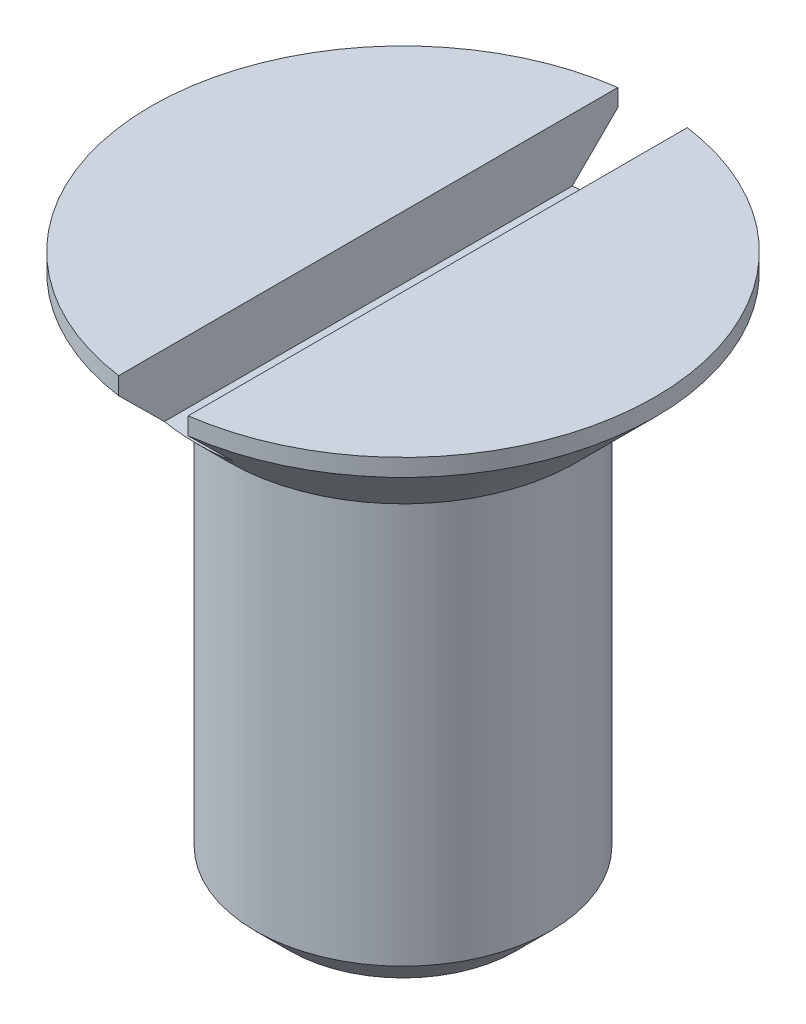
ISO-10303-21;
HEADER;
FILE_DESCRIPTION(('STEP AP214'),'2;1');
FILE_NAME('part.step','',(''),(''),'','','');
FILE_SCHEMA(('AUTOMOTIVE_DESIGN { 1 0 10303 214 1 1 1 1 }'));
ENDSEC;
DATA;
#1=APPLICATION_CONTEXT('core data for automotive mechanical design processes');
#2=APPLICATION_PROTOCOL_DEFINITION('international standard','automotive_design',2000,#1);
#3=PRODUCT_CONTEXT('',#1,'mechanical');
#4=PRODUCT('Part','Part','',(#3));
#5=PRODUCT_RELATED_PRODUCT_CATEGORY('part','',(#4));
#6=PRODUCT_DEFINITION_FORMATION('','',#4);
#7=PRODUCT_DEFINITION_CONTEXT('part definition',#1,'design');
#8=PRODUCT_DEFINITION('design','',#6,#7);
#9=PRODUCT_DEFINITION_SHAPE('','',#8);
#10=(LENGTH_UNIT() NAMED_UNIT(*) SI_UNIT(.MILLI.,.METRE.));
#11=(NAMED_UNIT(*) PLANE_ANGLE_UNIT() SI_UNIT($,.RADIAN.));
#12=(NAMED_UNIT(*) SI_UNIT($,.STERADIAN.) SOLID_ANGLE_UNIT());
#13=UNCERTAINTY_MEASURE_WITH_UNIT(LENGTH_MEASURE(1.E-05),#10,'distance_accuracy_value','');
#14=(GEOMETRIC_REPRESENTATION_CONTEXT(3) GLOBAL_UNCERTAINTY_ASSIGNED_CONTEXT((#13)) GLOBAL_UNIT_ASSIGNED_CONTEXT((#10,
#11,#12)) REPRESENTATION_CONTEXT('',''));
#15=CARTESIAN_POINT('',(0.,0.,0.));
#16=DIRECTION('',(0.,0.,1.));
#17=DIRECTION('',(1.,0.,0.));
#18=AXIS2_PLACEMENT_3D('',#15,#16,#17);
#19=CARTESIAN_POINT('',(0.,0.275,0.));
#20=DIRECTION('',(0.,-1.,0.));
#21=DIRECTION('',(0.,0.,-1.));
#22=AXIS2_PLACEMENT_3D('',#19,#20,#21);
#23=CYLINDRICAL_SURFACE('',#22,0.725);
#24=CARTESIAN_POINT('',(0.,0.275,0.));
#25=DIRECTION('',(0.,1.,0.));
#26=DIRECTION('',(0.,0.,1.));
#27=AXIS2_PLACEMENT_3D('',#24,#25,#26);
#28=CIRCLE('',#27,0.725);
#29=CARTESIAN_POINT('',(0.100000000001111,0.275,0.718070330817099));
#30=VERTEX_POINT('',#29);
#31=CARTESIAN_POINT('',(0.100000000001111,0.275,-0.718070330817099));
#32=VERTEX_POINT('',#31);
#33=EDGE_CURVE('E129',#30,#32,#28,.T.);
#34=ORIENTED_EDGE('',*,*,#33,.F.);
#35=DIRECTION('',(0.,-1.,0.));
#36=VECTOR('',#35,1.);
#37=CARTESIAN_POINT('',(0.100000000001111,0.275000000000304,0.718070330817099));
#38=LINE('',#37,#36);
#39=CARTESIAN_POINT('',(0.100000000001264,0.224999999999999,0.718070330817077));
#40=VERTEX_POINT('',#39);
#41=EDGE_CURVE('E106',#30,#40,#38,.T.);
#42=ORIENTED_EDGE('',*,*,#41,.T.);
#43=CARTESIAN_POINT('',(0.,0.224999999999999,0.));
#44=DIRECTION('',(0.,1.,0.));
#45=DIRECTION('',(0.,0.,1.));
#46=AXIS2_PLACEMENT_3D('',#43,#44,#45);
#47=CIRCLE('',#46,0.725);
#48=CARTESIAN_POINT('',(0.100000000001111,0.224999999999999,-0.718070330817099));
#49=VERTEX_POINT('',#48);
#50=EDGE_CURVE('E111',#40,#49,#47,.T.);
#51=ORIENTED_EDGE('',*,*,#50,.T.);
#52=DIRECTION('',(0.,-1.,0.));
#53=VECTOR('',#52,1.);
#54=CARTESIAN_POINT('',(0.100000000001111,0.275000000000304,-0.718070330817099));
#55=LINE('',#54,#53);
#56=EDGE_CURVE('E142',#49,#32,#55,.F.);
#57=ORIENTED_EDGE('',*,*,#56,.T.);
#58=EDGE_LOOP('',(#34,#42,#51,#57));
#59=FACE_BOUND('',#58,.T.);
#60=ADVANCED_FACE('F35',(#59),#23,.T.);
#61=CARTESIAN_POINT('',(0.,0.275,0.));
#62=DIRECTION('',(0.,1.,0.));
#63=DIRECTION('',(0.,0.,1.));
#64=AXIS2_PLACEMENT_3D('',#61,#62,#63);
#65=PLANE('',#64);
#66=DIRECTION('',(0.,0.,1.));
#67=VECTOR('',#66,1.);
#68=CARTESIAN_POINT('',(-0.100000000001113,0.275,0.));
#69=LINE('',#68,#67);
#70=CARTESIAN_POINT('',(-0.100000000001113,0.275,-0.718070330817098));
#71=VERTEX_POINT('',#70);
#72=CARTESIAN_POINT('',(-0.100000000001113,0.275,0.718070330817098));
#73=VERTEX_POINT('',#72);
#74=EDGE_CURVE('E137',#71,#73,#69,.T.);
#75=ORIENTED_EDGE('',*,*,#74,.F.);
#76=EDGE_CURVE('E130',#71,#73,#28,.T.);
#77=ORIENTED_EDGE('',*,*,#76,.T.);
#78=EDGE_LOOP('',(#75,#77));
#79=FACE_BOUND('',#78,.T.);
#80=ADVANCED_FACE('F158',(#79),#65,.T.);
#81=ORIENTED_EDGE('',*,*,#76,.F.);
#82=DIRECTION('',(0.,-1.,0.));
#83=VECTOR('',#82,1.);
#84=CARTESIAN_POINT('',(-0.100000000001113,0.275000000000304,-0.718070330817098));
#85=LINE('',#84,#83);
#86=CARTESIAN_POINT('',(-0.100000000001265,0.224999999999999,-0.718070330817077));
#87=VERTEX_POINT('',#86);
#88=EDGE_CURVE('E139',#71,#87,#85,.T.);
#89=ORIENTED_EDGE('',*,*,#88,.T.);
#90=CARTESIAN_POINT('',(-0.100000000001113,0.224999999999999,0.718070330817098));
#91=VERTEX_POINT('',#90);
#92=EDGE_CURVE('E120',#87,#91,#47,.T.);
#93=ORIENTED_EDGE('',*,*,#92,.T.);
#94=DIRECTION('',(0.,-1.,0.));
#95=VECTOR('',#94,1.);
#96=CARTESIAN_POINT('',(-0.100000000001113,0.275000000000304,0.718070330817098));
#97=LINE('',#96,#95);
#98=EDGE_CURVE('E63',#91,#73,#97,.F.);
#99=ORIENTED_EDGE('',*,*,#98,.T.);
#100=EDGE_LOOP('',(#81,#89,#93,#99));
#101=FACE_BOUND('',#100,.T.);
#102=ADVANCED_FACE('F156',(#101),#23,.T.);
#103=DIRECTION('',(0.,0.,-1.));
#104=VECTOR('',#103,1.);
#105=CARTESIAN_POINT('',(0.100000000001111,0.275,0.));
#106=LINE('',#105,#104);
#107=EDGE_CURVE('E145',#30,#32,#106,.T.);
#108=ORIENTED_EDGE('',*,*,#107,.F.);
#109=ORIENTED_EDGE('',*,*,#33,.T.);
#110=EDGE_LOOP('',(#108,#109));
#111=FACE_BOUND('',#110,.T.);
#112=ADVANCED_FACE('F153',(#111),#65,.T.);
#113=CARTESIAN_POINT('',(0.,0.,0.));
#114=DIRECTION('',(0.,1.,0.));
#115=DIRECTION('',(0.,0.,1.));
#116=AXIS2_PLACEMENT_3D('',#113,#114,#115);
#117=PLANE('',#116);
#118=CARTESIAN_POINT('',(0.,0.,0.));
#119=DIRECTION('',(0.,1.,0.));
#120=DIRECTION('',(0.,0.,1.));
#121=AXIS2_PLACEMENT_3D('',#118,#119,#120);
#122=CIRCLE('',#121,0.499999999999999);
#123=CARTESIAN_POINT('',(0.,0.,0.499999999999999));
#124=VERTEX_POINT('',#123);
#125=EDGE_CURVE('E116',#124,#124,#122,.F.);
#126=ORIENTED_EDGE('',*,*,#125,.T.);
#127=EDGE_LOOP('',(#126));
#128=FACE_BOUND('',#127,.T.);
#129=CARTESIAN_POINT('',(0.,0.,0.));
#130=DIRECTION('',(0.,1.,0.));
#131=DIRECTION('',(0.,0.,1.));
#132=AXIS2_PLACEMENT_3D('',#129,#130,#131);
#133=CIRCLE('',#132,0.425);
#134=CARTESIAN_POINT('',(0.,0.,0.425));
#135=VERTEX_POINT('',#134);
#136=EDGE_CURVE('E133',#135,#135,#133,.T.);
#137=ORIENTED_EDGE('',*,*,#136,.T.);
#138=EDGE_LOOP('',(#137));
#139=FACE_BOUND('',#138,.T.);
#140=ADVANCED_FACE('F155',(#128,#139),#117,.F.);
#141=CARTESIAN_POINT('',(0.,-1.305,0.));
#142=DIRECTION('',(0.,1.,0.));
#143=DIRECTION('',(0.,0.,1.));
#144=AXIS2_PLACEMENT_3D('',#141,#142,#143);
#145=CYLINDRICAL_SURFACE('',#144,0.425);
#146=CARTESIAN_POINT('',(0.,-1.205,0.));
#147=DIRECTION('',(0.,1.,0.));
#148=DIRECTION('',(0.,0.,1.));
#149=AXIS2_PLACEMENT_3D('',#146,#147,#148);
#150=CIRCLE('',#149,0.425);
#151=CARTESIAN_POINT('',(0.,-1.205,0.425));
#152=VERTEX_POINT('',#151);
#153=EDGE_CURVE('E126',#152,#152,#150,.T.);
#154=ORIENTED_EDGE('',*,*,#153,.T.);
#155=EDGE_LOOP('',(#154));
#156=FACE_BOUND('',#155,.T.);
#157=ORIENTED_EDGE('',*,*,#136,.F.);
#158=EDGE_LOOP('',(#157));
#159=FACE_BOUND('',#158,.T.);
#160=ADVANCED_FACE('F163',(#156,#159),#145,.T.);
#161=CARTESIAN_POINT('',(0.,-1.305,0.));
#162=DIRECTION('',(0.,1.,0.));
#163=DIRECTION('',(0.,0.,1.));
#164=AXIS2_PLACEMENT_3D('',#161,#162,#163);
#165=PLANE('',#164);
#166=CARTESIAN_POINT('',(0.,-1.305,0.));
#167=DIRECTION('',(0.,1.,0.));
#168=DIRECTION('',(0.,0.,1.));
#169=AXIS2_PLACEMENT_3D('',#166,#167,#168);
#170=CIRCLE('',#169,0.325);
#171=CARTESIAN_POINT('',(0.,-1.305,0.325));
#172=VERTEX_POINT('',#171);
#173=EDGE_CURVE('E123',#172,#172,#170,.F.);
#174=ORIENTED_EDGE('',*,*,#173,.T.);
#175=EDGE_LOOP('',(#174));
#176=FACE_BOUND('',#175,.T.);
#177=ADVANCED_FACE('F176',(#176),#165,.F.);
#178=CARTESIAN_POINT('',(0.,-1.205,0.));
#179=DIRECTION('',(0.,1.,0.));
#180=DIRECTION('',(0.,0.,1.));
#181=AXIS2_PLACEMENT_3D('',#178,#179,#180);
#182=CONICAL_SURFACE('',#181,0.425,0.785398163397453);
#183=ORIENTED_EDGE('',*,*,#173,.F.);
#184=EDGE_LOOP('',(#183));
#185=FACE_BOUND('',#184,.T.);
#186=ORIENTED_EDGE('',*,*,#153,.F.);
#187=EDGE_LOOP('',(#186));
#188=FACE_BOUND('',#187,.T.);
#189=ADVANCED_FACE('F174',(#185,#188),#182,.T.);
#190=CARTESIAN_POINT('',(0.,0.224999999999999,0.));
#191=DIRECTION('',(0.,1.,0.));
#192=DIRECTION('',(0.,0.,1.));
#193=AXIS2_PLACEMENT_3D('',#190,#191,#192);
#194=CONICAL_SURFACE('',#193,0.725,0.785398163397453);
#195=CARTESIAN_POINT('',(-0.0999999999986122,1.09868955345819,1.59555892662623));
#196=CARTESIAN_POINT('',(-0.0999999999987761,1.0447290051601,1.5414917258165));
#197=CARTESIAN_POINT('',(-0.0999999999989399,0.990773095254003,1.48741989478673));
#198=CARTESIAN_POINT('',(-0.0999999999992675,0.882875327429765,1.37926028570665));
#199=CARTESIAN_POINT('',(-0.0999999999994313,0.828933469780175,1.32517250738844));
#200=CARTESIAN_POINT('',(-0.0999999999997589,0.721050579543685,1.21695625642465));
#201=CARTESIAN_POINT('',(-0.0999999999999227,0.667109554630013,1.16282777612706));
#202=CARTESIAN_POINT('',(-0.10000000000025,0.559259999897486,1.05454034697572));
#203=CARTESIAN_POINT('',(-0.100000000000414,0.505351469527597,1.00038139867056));
#204=CARTESIAN_POINT('',(-0.100000000000748,0.395272506513327,0.88969046352706));
#205=CARTESIAN_POINT('',(-0.100000000000919,0.339104231207045,0.833156327944147));
#206=CARTESIAN_POINT('',(-0.100000000001259,0.226863567970149,0.719987306212762));
#207=CARTESIAN_POINT('',(-0.10000000000143,0.170791185159521,0.663352414994952));
#208=CARTESIAN_POINT('',(-0.10000000000177,0.0588455546717931,0.549910338078833));
#209=CARTESIAN_POINT('',(-0.100000000001939,0.00297226480124215,0.493103194271966));
#210=CARTESIAN_POINT('',(-0.100000000002193,-0.0804424958830876,0.407512285459896));
#211=CARTESIAN_POINT('',(-0.100000000002277,-0.108180348906693,0.378919876199846));
#212=CARTESIAN_POINT('',(-0.100000000002444,-0.16340797114462,0.321496839472886));
#213=CARTESIAN_POINT('',(-0.100000000002528,-0.190897752299457,0.292666223600985));
#214=CARTESIAN_POINT('',(-0.100000000002655,-0.232672232605019,0.247978693778389));
#215=CARTESIAN_POINT('',(-0.100000000002699,-0.247161761978657,0.232313452359119));
#216=CARTESIAN_POINT('',(-0.100000000002786,-0.275792918912739,0.20078264020941));
#217=CARTESIAN_POINT('',(-0.100000000002829,-0.289935739349932,0.184918168653613));
#218=CARTESIAN_POINT('',(-0.100000000002899,-0.313062879166142,0.158036198310751));
#219=CARTESIAN_POINT('',(-0.100000000002927,-0.322204177425788,0.14715380163464));
#220=CARTESIAN_POINT('',(-0.100000000002981,-0.340109833114381,0.124934108596838));
#221=CARTESIAN_POINT('',(-0.100000000003008,-0.348870797208951,0.113593983237824));
#222=CARTESIAN_POINT('',(-0.100000000003059,-0.365665248057626,0.0900964338078324));
#223=CARTESIAN_POINT('',(-0.100000000003083,-0.373683627302715,0.0779283057932793));
#224=CARTESIAN_POINT('',(-0.100000000003125,-0.387573075785569,0.0524496955094402));
#225=CARTESIAN_POINT('',(-0.100000000003143,-0.393473956414082,0.039158618487004));
#226=CARTESIAN_POINT('',(-0.100000000003158,-0.39846780587856,0.0186547557846043));
#227=CARTESIAN_POINT('',(-0.100000000003161,-0.399511958243123,0.011961971229929));
#228=CARTESIAN_POINT('',(-0.100000000003163,-0.400213757853222,-0.00148391938471653));
#229=CARTESIAN_POINT('',(-0.100000000003162,-0.399874864780544,-0.00823683281475823));
#230=CARTESIAN_POINT('',(-0.100000000003157,-0.397928903841934,-0.0214837121828794));
#231=CARTESIAN_POINT('',(-0.100000000003152,-0.396332668650912,-0.0279793945211188));
#232=CARTESIAN_POINT('',(-0.100000000003139,-0.392207875949007,-0.0406872130071795));
#233=CARTESIAN_POINT('',(-0.100000000003131,-0.389674587176084,-0.0468977272648022));
#234=CARTESIAN_POINT('',(-0.100000000003105,-0.380963245155626,-0.0655408034226342));
#235=CARTESIAN_POINT('',(-0.100000000003083,-0.373792885835698,-0.0774918358503833));
#236=CARTESIAN_POINT('',(-0.100000000003036,-0.358355552008178,-0.100677854622944));
#237=CARTESIAN_POINT('',(-0.100000000003011,-0.350083365445338,-0.111909036627538));
#238=CARTESIAN_POINT('',(-0.100000000002959,-0.33289705936056,-0.134061306995939));
#239=CARTESIAN_POINT('',(-0.100000000002932,-0.323977091962145,-0.144977878261052));
#240=CARTESIAN_POINT('',(-0.100000000002877,-0.305849460400053,-0.166515917391959));
#241=CARTESIAN_POINT('',(-0.100000000002849,-0.296642597772952,-0.177138073890807));
#242=CARTESIAN_POINT('',(-0.100000000002766,-0.269239059826638,-0.208196290834921));
#243=CARTESIAN_POINT('',(-0.10000000000271,-0.250783256539323,-0.228403210782052));
#244=CARTESIAN_POINT('',(-0.100000000002597,-0.213553406551243,-0.268522548943027));
#245=CARTESIAN_POINT('',(-0.10000000000254,-0.194779314309493,-0.288434924236869));
#246=CARTESIAN_POINT('',(-0.100000000002368,-0.138190527326739,-0.347939163140773));
#247=CARTESIAN_POINT('',(-0.100000000002252,-0.100119451451569,-0.38728711451068));
#248=CARTESIAN_POINT('',(-0.10000000000202,-0.0236633053296243,-0.465799418970578));
#249=CARTESIAN_POINT('',(-0.100000000001904,0.0147221760253241,-0.504963367514776));
#250=CARTESIAN_POINT('',(-0.10000000000167,0.0916216601318871,-0.583152749650161));
#251=CARTESIAN_POINT('',(-0.100000000001553,0.130135641067924,-0.622178204641991));
#252=CARTESIAN_POINT('',(-0.10000000000132,0.207019587138332,-0.699935298410583));
#253=CARTESIAN_POINT('',(-0.100000000001203,0.245389135090592,-0.738667350746377));
#254=CARTESIAN_POINT('',(-0.10000000000097,0.322176353354998,-0.816087150965447));
#255=CARTESIAN_POINT('',(-0.100000000000853,0.360594025724342,-0.854774896809302));
#256=CARTESIAN_POINT('',(-0.100000000000503,0.475836909201126,-0.970738182766618));
#257=CARTESIAN_POINT('',(-0.10000000000027,0.552706901333665,-1.04796920044315));
#258=CARTESIAN_POINT('',(-0.0999999999997994,0.707713875101,-1.20358627681447));
#259=CARTESIAN_POINT('',(-0.0999999999995621,0.785851782599132,-1.28197141283885));
#260=CARTESIAN_POINT('',(-0.0999999999990873,0.942220505077365,-1.43875981419977));
#261=CARTESIAN_POINT('',(-0.0999999999988498,1.02045134665524,-1.51716305301229));
#262=CARTESIAN_POINT('',(-0.0999999999986122,1.09868955345819,-1.59555892662623));
#263=B_SPLINE_CURVE_WITH_KNOTS('',3,(#195,#196,#197,#198,#199,#200,#201,#202,#203,#204,#205,
#206,#207,#208,#209,#210,#211,#212,#213,#214,#215,#216,#217,#218,#219,#220,#221,#222,#223,#224,
#225,#226,#227,#228,#229,#230,#231,#232,#233,#234,#235,#236,#237,#238,#239,#240,#241,#242,#243,
#244,#245,#246,#247,#248,#249,#250,#251,#252,#253,#254,#255,#256,#257,#258,#259,#260,#261,#262),
.UNSPECIFIED.,.F.,.F.,(4,2,2,2,2,2,2,2,2,2,2,2,2,2,2,2,2,2,2,2,2,2,2,2,2,2,2,2,2,2,2,2,2,4),(0.,
0.229161573574403,0.458327245364694,0.68757761455422,0.916823980178877,1.15590299184223,
1.39499439322453,1.63403168721678,1.75353987802665,1.87304228549908,1.93705784571768,
2.00080812643927,2.04344216335291,2.08640026709964,2.13009737778993,2.17315262954245,
2.19334549729318,2.21348788367941,2.2334586059387,2.25353156992612,2.29516382637097,
2.33700051903817,2.3792782486118,2.42144691379871,2.50353645928141,2.58563785100853,
2.74988554329754,2.9144013473636,3.07889051419821,3.24244952192401,3.40601577779473,
3.73291421283673,4.06495013252533,4.39722137631356),.UNSPECIFIED.);
#264=CARTESIAN_POINT('',(-0.10000000000166,0.0949999999936996,0.586536443873841));
#265=VERTEX_POINT('',#264);
#266=EDGE_CURVE('E11',#91,#265,#263,.T.);
#267=ORIENTED_EDGE('',*,*,#266,.F.);
#268=ORIENTED_EDGE('',*,*,#92,.F.);
#269=CARTESIAN_POINT('',(-0.10000000000166,0.0949999999936996,-0.586536443873841));
#270=VERTEX_POINT('',#269);
#271=EDGE_CURVE('E40',#270,#87,#263,.T.);
#272=ORIENTED_EDGE('',*,*,#271,.F.);
#273=CARTESIAN_POINT('',(0.,0.0949999999936996,0.));
#274=DIRECTION('',(0.,-1.,0.));
#275=DIRECTION('',(0.,0.,-1.));
#276=AXIS2_PLACEMENT_3D('',#273,#274,#275);
#277=CIRCLE('',#276,0.5949999999937);
#278=CARTESIAN_POINT('',(0.100000000001659,0.0949999999936996,-0.586536443873841));
#279=VERTEX_POINT('',#278);
#280=EDGE_CURVE('E99',#279,#270,#277,.F.);
#281=ORIENTED_EDGE('',*,*,#280,.F.);
#282=CARTESIAN_POINT('',(0.0999999999986046,1.09868955345819,-1.59555892662623));
#283=CARTESIAN_POINT('',(0.0999999999987688,1.0447290051601,-1.5414917258165));
#284=CARTESIAN_POINT('',(0.099999999998933,0.990773095254004,-1.48741989478673));
#285=CARTESIAN_POINT('',(0.0999999999992614,0.882875327429768,-1.37926028570665));
#286=CARTESIAN_POINT('',(0.0999999999994255,0.828933469780179,-1.32517250738845));
#287=CARTESIAN_POINT('',(0.0999999999997539,0.72105057954369,-1.21695625642466));
#288=CARTESIAN_POINT('',(0.099999999999918,0.667109554630018,-1.16282777612707));
#289=CARTESIAN_POINT('',(0.100000000000246,0.559259999897493,-1.05454034697572));
#290=CARTESIAN_POINT('',(0.10000000000041,0.505351469527605,-1.00038139867057));
#291=CARTESIAN_POINT('',(0.100000000000745,0.395272506513335,-0.889690463527068));
#292=CARTESIAN_POINT('',(0.100000000000916,0.339104231207052,-0.833156327944154));
#293=CARTESIAN_POINT('',(0.100000000001258,0.226863567970154,-0.719987306212768));
#294=CARTESIAN_POINT('',(0.100000000001429,0.170791185159526,-0.663352414994957));
#295=CARTESIAN_POINT('',(0.100000000001769,0.0588455546717966,-0.549910338078836));
#296=CARTESIAN_POINT('',(0.100000000001939,0.00297226480124506,-0.493103194271968));
#297=CARTESIAN_POINT('',(0.100000000002193,-0.0804424958830857,-0.407512285459898));
#298=CARTESIAN_POINT('',(0.100000000002278,-0.108180348906692,-0.378919876199848));
#299=CARTESIAN_POINT('',(0.100000000002446,-0.163407971144619,-0.321496839472887));
#300=CARTESIAN_POINT('',(0.100000000002529,-0.190897752299456,-0.292666223600985));
#301=CARTESIAN_POINT('',(0.100000000002656,-0.232672232605019,-0.247978693778389));
#302=CARTESIAN_POINT('',(0.100000000002701,-0.247161761978656,-0.232313452359119));
#303=CARTESIAN_POINT('',(0.100000000002788,-0.275792918912739,-0.200782640209409));
#304=CARTESIAN_POINT('',(0.100000000002831,-0.289935739349931,-0.184918168653613));
#305=CARTESIAN_POINT('',(0.100000000002901,-0.313062879166141,-0.15803619831075));
#306=CARTESIAN_POINT('',(0.100000000002929,-0.322204177425788,-0.147153801634638));
#307=CARTESIAN_POINT('',(0.100000000002983,-0.340109833114382,-0.124934108596835));
#308=CARTESIAN_POINT('',(0.10000000000301,-0.348870797208952,-0.11359398323782));
#309=CARTESIAN_POINT('',(0.100000000003061,-0.365665248057627,-0.090096433807827));
#310=CARTESIAN_POINT('',(0.100000000003086,-0.373683627302718,-0.077928305793273));
#311=CARTESIAN_POINT('',(0.100000000003128,-0.387573075785571,-0.0524496955094317));
#312=CARTESIAN_POINT('',(0.100000000003146,-0.393473956414083,-0.0391586184869943));
#313=CARTESIAN_POINT('',(0.100000000003161,-0.398467805878559,-0.0186547557845932));
#314=CARTESIAN_POINT('',(0.100000000003164,-0.399511958243122,-0.0119619712299175));
#315=CARTESIAN_POINT('',(0.100000000003166,-0.400213757853219,0.00148391938472821));
#316=CARTESIAN_POINT('',(0.100000000003165,-0.39987486478054,0.00823683281476986));
#317=CARTESIAN_POINT('',(0.100000000003159,-0.397928903841928,0.0214837121828909));
#318=CARTESIAN_POINT('',(0.100000000003154,-0.396332668650907,0.0279793945211302));
#319=CARTESIAN_POINT('',(0.100000000003142,-0.392207875949001,0.0406872130071906));
#320=CARTESIAN_POINT('',(0.100000000003134,-0.389674587176077,0.0468977272648132));
#321=CARTESIAN_POINT('',(0.100000000003108,-0.380963245155616,0.0655408034226493));
#322=CARTESIAN_POINT('',(0.100000000003086,-0.373792885835684,0.0774918358504025));
#323=CARTESIAN_POINT('',(0.100000000003039,-0.358355552008157,0.100677854622971));
#324=CARTESIAN_POINT('',(0.100000000003014,-0.350083365445313,0.111909036627568));
#325=CARTESIAN_POINT('',(0.100000000002961,-0.332897059360528,0.134061306995977));
#326=CARTESIAN_POINT('',(0.100000000002934,-0.323977091962109,0.144977878261094));
#327=CARTESIAN_POINT('',(0.100000000002879,-0.30584946040001,0.166515917392009));
#328=CARTESIAN_POINT('',(0.100000000002851,-0.296642597772905,0.17713807389086));
#329=CARTESIAN_POINT('',(0.100000000002768,-0.26923905982658,0.208196290834985));
#330=CARTESIAN_POINT('',(0.100000000002712,-0.250783256539258,0.228403210782123));
#331=CARTESIAN_POINT('',(0.100000000002598,-0.213553406551163,0.268522548943112));
#332=CARTESIAN_POINT('',(0.100000000002541,-0.194779314309406,0.288434924236961));
#333=CARTESIAN_POINT('',(0.100000000002369,-0.138190527326629,0.347939163140887));
#334=CARTESIAN_POINT('',(0.100000000002253,-0.100119451451445,0.387287114510808));
#335=CARTESIAN_POINT('',(0.10000000000202,-0.0236633053294711,0.465799418970735));
#336=CARTESIAN_POINT('',(0.100000000001903,0.0147221760254917,0.504963367514947));
#337=CARTESIAN_POINT('',(0.100000000001669,0.0916216601320837,0.58315274965036));
#338=CARTESIAN_POINT('',(0.100000000001552,0.130135641068135,0.622178204642205));
#339=CARTESIAN_POINT('',(0.100000000001318,0.207019587138548,0.699935298410802));
#340=CARTESIAN_POINT('',(0.100000000001201,0.245389135090799,0.738667350746586));
#341=CARTESIAN_POINT('',(0.100000000000968,0.322176353355187,0.816087150965638));
#342=CARTESIAN_POINT('',(0.100000000000851,0.360594025724522,0.854774896809483));
#343=CARTESIAN_POINT('',(0.1000000000005,0.475836909201279,0.970738182766771));
#344=CARTESIAN_POINT('',(0.100000000000266,0.5527069013338,1.04796920044328));
#345=CARTESIAN_POINT('',(0.0999999999997944,0.707713875101097,1.20358627681456));
#346=CARTESIAN_POINT('',(0.0999999999995567,0.78585178259921,1.28197141283893));
#347=CARTESIAN_POINT('',(0.0999999999990808,0.942220505077404,1.43875981419981));
#348=CARTESIAN_POINT('',(0.0999999999988427,1.02045134665526,1.51716305301231));
#349=CARTESIAN_POINT('',(0.0999999999986046,1.09868955345819,1.59555892662623));
#350=B_SPLINE_CURVE_WITH_KNOTS('',3,(#282,#283,#284,#285,#286,#287,#288,#289,#290,#291,#292,
#293,#294,#295,#296,#297,#298,#299,#300,#301,#302,#303,#304,#305,#306,#307,#308,#309,#310,#311,
#312,#313,#314,#315,#316,#317,#318,#319,#320,#321,#322,#323,#324,#325,#326,#327,#328,#329,#330,
#331,#332,#333,#334,#335,#336,#337,#338,#339,#340,#341,#342,#343,#344,#345,#346,#347,#348,#349),
.UNSPECIFIED.,.F.,.F.,(4,2,2,2,2,2,2,2,2,2,2,2,2,2,2,2,2,2,2,2,2,2,2,2,2,2,2,2,2,2,2,2,2,4),(0.,
0.2291615735744,0.458327245364688,0.687577614554211,0.916823980178865,1.15590299184222,
1.39499439322452,1.63403168721677,1.75353987802665,1.87304228549908,1.93705784571768,
2.00080812643927,2.04344216335291,2.08640026709965,2.13009737778993,2.17315262954246,
2.19334549729319,2.21348788367943,2.23345860593871,2.25353156992613,2.295163826371,
2.33700051903822,2.37927824861186,2.42144691379879,2.50353645928152,2.58563785100866,
2.74988554329774,2.91440134736386,3.07889051419853,3.24244952192429,3.40601577779497,
3.73291421283689,4.06495013252541,4.39722137631355),.UNSPECIFIED.);
#351=EDGE_CURVE('E104',#49,#279,#350,.T.);
#352=ORIENTED_EDGE('',*,*,#351,.F.);
#353=ORIENTED_EDGE('',*,*,#50,.F.);
#354=CARTESIAN_POINT('',(0.100000000001659,0.0949999999936996,0.586536443873841));
#355=VERTEX_POINT('',#354);
#356=EDGE_CURVE('E49',#355,#40,#350,.T.);
#357=ORIENTED_EDGE('',*,*,#356,.F.);
#358=EDGE_CURVE('E92',#265,#355,#277,.F.);
#359=ORIENTED_EDGE('',*,*,#358,.F.);
#360=EDGE_LOOP('',(#267,#268,#272,#281,#352,#353,#357,#359));
#361=FACE_BOUND('',#360,.T.);
#362=ORIENTED_EDGE('',*,*,#125,.F.);
#363=EDGE_LOOP('',(#362));
#364=FACE_BOUND('',#363,.T.);
#365=ADVANCED_FACE('F37',(#361,#364),#194,.T.);
#366=CARTESIAN_POINT('',(-0.1,0.641644051142976,-0.725));
#367=DIRECTION('',(-1.,3.03637925793865E-12,0.));
#368=DIRECTION('',(-3.03637925793865E-12,-1.,0.));
#369=AXIS2_PLACEMENT_3D('',#366,#367,#368);
#370=PLANE('',#369);
#371=ORIENTED_EDGE('',*,*,#266,.T.);
#372=DIRECTION('',(0.,0.,1.));
#373=VECTOR('',#372,1.);
#374=CARTESIAN_POINT('',(-0.10000000000166,0.0949999999936996,-0.725));
#375=LINE('',#374,#373);
#376=EDGE_CURVE('E95',#270,#265,#375,.T.);
#377=ORIENTED_EDGE('',*,*,#376,.F.);
#378=ORIENTED_EDGE('',*,*,#271,.T.);
#379=ORIENTED_EDGE('',*,*,#88,.F.);
#380=ORIENTED_EDGE('',*,*,#74,.T.);
#381=ORIENTED_EDGE('',*,*,#98,.F.);
#382=EDGE_LOOP('',(#371,#377,#378,#379,#380,#381));
#383=FACE_BOUND('',#382,.T.);
#384=ADVANCED_FACE('F182',(#383),#370,.F.);
#385=CARTESIAN_POINT('',(0.0999999999999955,0.641644051142976,-0.725));
#386=DIRECTION('',(1.,3.0433706678881E-12,0.));
#387=DIRECTION('',(-3.0433706678881E-12,1.,0.));
#388=AXIS2_PLACEMENT_3D('',#385,#386,#387);
#389=PLANE('',#388);
#390=ORIENTED_EDGE('',*,*,#351,.T.);
#391=DIRECTION('',(0.,0.,1.));
#392=VECTOR('',#391,1.);
#393=CARTESIAN_POINT('',(0.100000000001659,0.0949999999936996,-0.725));
#394=LINE('',#393,#392);
#395=EDGE_CURVE('E56',#279,#355,#394,.T.);
#396=ORIENTED_EDGE('',*,*,#395,.T.);
#397=ORIENTED_EDGE('',*,*,#356,.T.);
#398=ORIENTED_EDGE('',*,*,#41,.F.);
#399=ORIENTED_EDGE('',*,*,#107,.T.);
#400=ORIENTED_EDGE('',*,*,#56,.F.);
#401=EDGE_LOOP('',(#390,#396,#397,#398,#399,#400));
#402=FACE_BOUND('',#401,.T.);
#403=ADVANCED_FACE('F101',(#402),#389,.F.);
#404=CARTESIAN_POINT('',(-0.10000000000166,0.0949999999936996,-0.725));
#405=DIRECTION('',(0.,-1.,0.));
#406=DIRECTION('',(0.,0.,-1.));
#407=AXIS2_PLACEMENT_3D('',#404,#405,#406);
#408=PLANE('',#407);
#409=ORIENTED_EDGE('',*,*,#358,.T.);
#410=ORIENTED_EDGE('',*,*,#395,.F.);
#411=ORIENTED_EDGE('',*,*,#280,.T.);
#412=ORIENTED_EDGE('',*,*,#376,.T.);
#413=EDGE_LOOP('',(#409,#410,#411,#412));
#414=FACE_BOUND('',#413,.T.);
#415=ADVANCED_FACE('F93',(#414),#408,.F.);
#416=CLOSED_SHELL('',(#60,#80,#102,#112,#140,#160,#177,#189,#365,#384,#403,#415));
#417=MANIFOLD_SOLID_BREP('B2',#416);
#418=ADVANCED_BREP_SHAPE_REPRESENTATION('',(#18,#417),#14);
#419=SHAPE_DEFINITION_REPRESENTATION(#9,#418);
ENDSEC;
END-ISO-10303-21;
